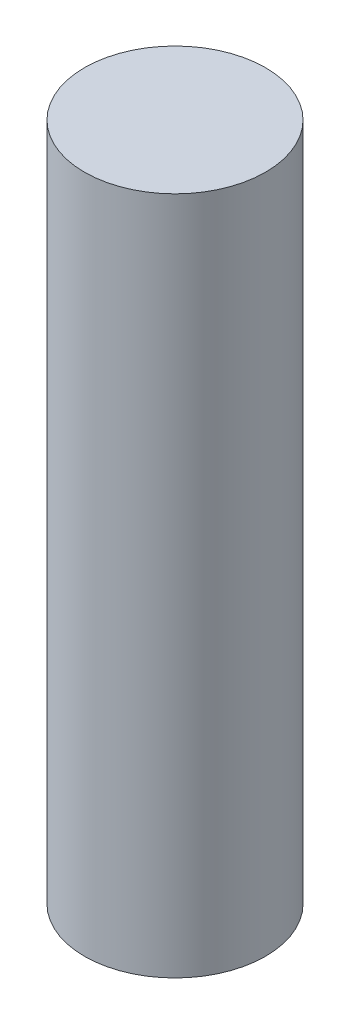
ISO-10303-21;
HEADER;
FILE_DESCRIPTION(('STEP AP214'),'2;1');
FILE_NAME('part.step','',(''),(''),'','','');
FILE_SCHEMA(('AUTOMOTIVE_DESIGN { 1 0 10303 214 1 1 1 1 }'));
ENDSEC;
DATA;
#1=APPLICATION_CONTEXT('core data for automotive mechanical design processes');
#2=APPLICATION_PROTOCOL_DEFINITION('international standard','automotive_design',2000,#1);
#3=PRODUCT_CONTEXT('',#1,'mechanical');
#4=PRODUCT('Part','Part','',(#3));
#5=PRODUCT_RELATED_PRODUCT_CATEGORY('part','',(#4));
#6=PRODUCT_DEFINITION_FORMATION('','',#4);
#7=PRODUCT_DEFINITION_CONTEXT('part definition',#1,'design');
#8=PRODUCT_DEFINITION('design','',#6,#7);
#9=PRODUCT_DEFINITION_SHAPE('','',#8);
#10=(LENGTH_UNIT() NAMED_UNIT(*) SI_UNIT(.MILLI.,.METRE.));
#11=(NAMED_UNIT(*) PLANE_ANGLE_UNIT() SI_UNIT($,.RADIAN.));
#12=(NAMED_UNIT(*) SI_UNIT($,.STERADIAN.) SOLID_ANGLE_UNIT());
#13=UNCERTAINTY_MEASURE_WITH_UNIT(LENGTH_MEASURE(1.E-05),#10,'distance_accuracy_value','');
#14=(GEOMETRIC_REPRESENTATION_CONTEXT(3) GLOBAL_UNCERTAINTY_ASSIGNED_CONTEXT((#13)) GLOBAL_UNIT_ASSIGNED_CONTEXT((#10,
#11,#12)) REPRESENTATION_CONTEXT('',''));
#15=CARTESIAN_POINT('',(0.,0.,0.));
#16=DIRECTION('',(0.,0.,1.));
#17=DIRECTION('',(1.,0.,0.));
#18=AXIS2_PLACEMENT_3D('',#15,#16,#17);
#19=CARTESIAN_POINT('',(0.,450.,0.));
#20=DIRECTION('',(0.,-1.,0.));
#21=DIRECTION('',(0.,0.,-1.));
#22=AXIS2_PLACEMENT_3D('',#19,#20,#21);
#23=CYLINDRICAL_SURFACE('',#22,60.);
#24=CARTESIAN_POINT('',(0.,450.,0.));
#25=DIRECTION('',(0.,1.,0.));
#26=DIRECTION('',(0.,0.,1.));
#27=AXIS2_PLACEMENT_3D('',#24,#25,#26);
#28=CIRCLE('',#27,60.);
#29=CARTESIAN_POINT('',(0.,450.,60.));
#30=VERTEX_POINT('',#29);
#31=EDGE_CURVE('E10',#30,#30,#28,.T.);
#32=ORIENTED_EDGE('',*,*,#31,.F.);
#33=EDGE_LOOP('',(#32));
#34=FACE_BOUND('',#33,.T.);
#35=CARTESIAN_POINT('',(0.,0.,0.));
#36=DIRECTION('',(0.,1.,0.));
#37=DIRECTION('',(0.,0.,1.));
#38=AXIS2_PLACEMENT_3D('',#35,#36,#37);
#39=CIRCLE('',#38,60.);
#40=CARTESIAN_POINT('',(0.,0.,60.));
#41=VERTEX_POINT('',#40);
#42=EDGE_CURVE('E39',#41,#41,#39,.T.);
#43=ORIENTED_EDGE('',*,*,#42,.T.);
#44=EDGE_LOOP('',(#43));
#45=FACE_BOUND('',#44,.T.);
#46=ADVANCED_FACE('F36',(#34,#45),#23,.T.);
#47=CARTESIAN_POINT('',(0.,450.,0.));
#48=DIRECTION('',(0.,1.,0.));
#49=DIRECTION('',(0.,0.,1.));
#50=AXIS2_PLACEMENT_3D('',#47,#48,#49);
#51=PLANE('',#50);
#52=ORIENTED_EDGE('',*,*,#31,.T.);
#53=EDGE_LOOP('',(#52));
#54=FACE_BOUND('',#53,.T.);
#55=ADVANCED_FACE('F51',(#54),#51,.T.);
#56=CARTESIAN_POINT('',(0.,0.,0.));
#57=DIRECTION('',(0.,1.,0.));
#58=DIRECTION('',(0.,0.,1.));
#59=AXIS2_PLACEMENT_3D('',#56,#57,#58);
#60=PLANE('',#59);
#61=ORIENTED_EDGE('',*,*,#42,.F.);
#62=EDGE_LOOP('',(#61));
#63=FACE_BOUND('',#62,.T.);
#64=ADVANCED_FACE('F49',(#63),#60,.F.);
#65=CLOSED_SHELL('',(#46,#55,#64));
#66=MANIFOLD_SOLID_BREP('B2',#65);
#67=ADVANCED_BREP_SHAPE_REPRESENTATION('',(#18,#66),#14);
#68=SHAPE_DEFINITION_REPRESENTATION(#9,#67);
ENDSEC;
END-ISO-10303-21;
